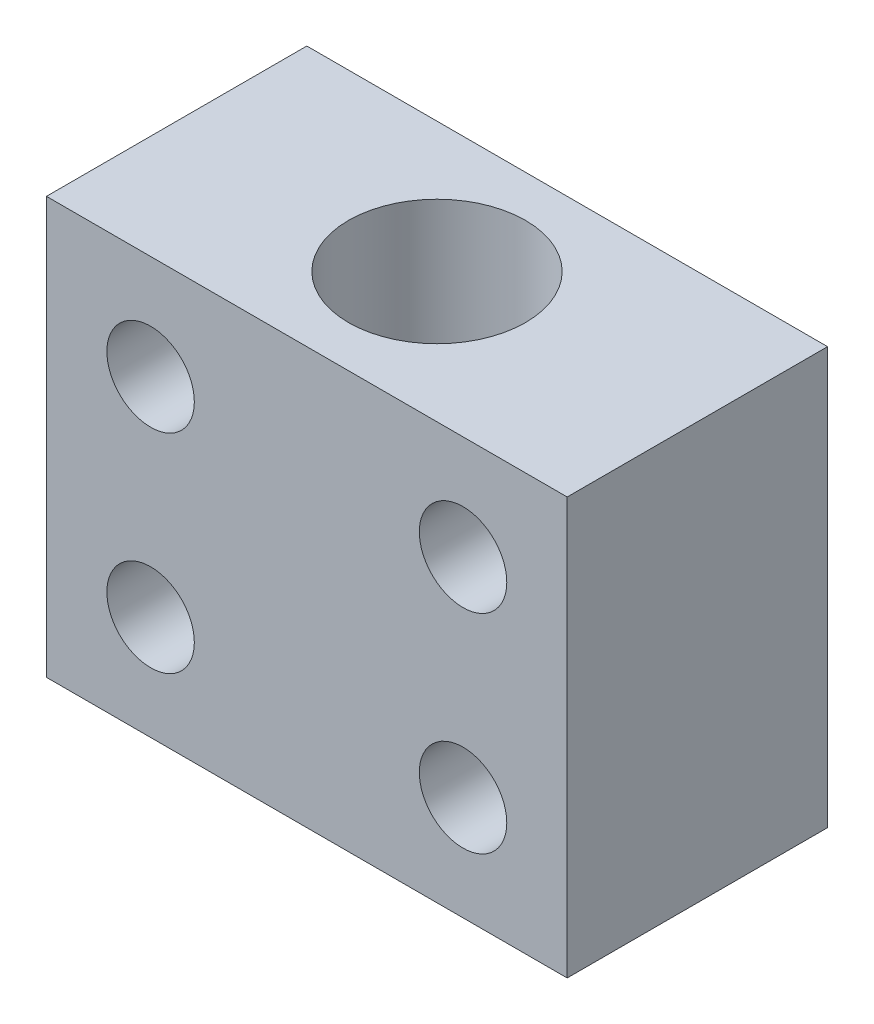
ISO-10303-21;
HEADER;
FILE_DESCRIPTION(('STEP AP214'),'2;1');
FILE_NAME('part.step','',(''),(''),'','','');
FILE_SCHEMA(('AUTOMOTIVE_DESIGN { 1 0 10303 214 1 1 1 1 }'));
ENDSEC;
DATA;
#1=APPLICATION_CONTEXT('core data for automotive mechanical design processes');
#2=APPLICATION_PROTOCOL_DEFINITION('international standard','automotive_design',2000,#1);
#3=PRODUCT_CONTEXT('',#1,'mechanical');
#4=PRODUCT('Part','Part','',(#3));
#5=PRODUCT_RELATED_PRODUCT_CATEGORY('part','',(#4));
#6=PRODUCT_DEFINITION_FORMATION('','',#4);
#7=PRODUCT_DEFINITION_CONTEXT('part definition',#1,'design');
#8=PRODUCT_DEFINITION('design','',#6,#7);
#9=PRODUCT_DEFINITION_SHAPE('','',#8);
#10=(LENGTH_UNIT() NAMED_UNIT(*) SI_UNIT(.MILLI.,.METRE.));
#11=(NAMED_UNIT(*) PLANE_ANGLE_UNIT() SI_UNIT($,.RADIAN.));
#12=(NAMED_UNIT(*) SI_UNIT($,.STERADIAN.) SOLID_ANGLE_UNIT());
#13=UNCERTAINTY_MEASURE_WITH_UNIT(LENGTH_MEASURE(1.E-05),#10,'distance_accuracy_value','');
#14=(GEOMETRIC_REPRESENTATION_CONTEXT(3) GLOBAL_UNCERTAINTY_ASSIGNED_CONTEXT((#13)) GLOBAL_UNIT_ASSIGNED_CONTEXT((#10,
#11,#12)) REPRESENTATION_CONTEXT('',''));
#15=CARTESIAN_POINT('',(0.,0.,0.));
#16=DIRECTION('',(0.,0.,1.));
#17=DIRECTION('',(1.,0.,0.));
#18=AXIS2_PLACEMENT_3D('',#15,#16,#17);
#19=CARTESIAN_POINT('',(0.,0.,-12.5));
#20=DIRECTION('',(0.,0.,-1.));
#21=DIRECTION('',(-1.,0.,0.));
#22=AXIS2_PLACEMENT_3D('',#19,#20,#21);
#23=PLANE('',#22);
#24=CARTESIAN_POINT('',(-15.,10.,-12.5));
#25=DIRECTION('',(0.,0.,1.));
#26=DIRECTION('',(1.,0.,0.));
#27=AXIS2_PLACEMENT_3D('',#24,#25,#26);
#28=CIRCLE('',#27,4.19999999999999);
#29=CARTESIAN_POINT('',(-10.8,10.,-12.5));
#30=VERTEX_POINT('',#29);
#31=EDGE_CURVE('E127',#30,#30,#28,.T.);
#32=ORIENTED_EDGE('',*,*,#31,.T.);
#33=EDGE_LOOP('',(#32));
#34=FACE_BOUND('',#33,.T.);
#35=DIRECTION('',(0.,1.,0.));
#36=VECTOR('',#35,1.);
#37=CARTESIAN_POINT('',(25.,-20.,-12.5));
#38=LINE('',#37,#36);
#39=CARTESIAN_POINT('',(25.,-20.,-12.5));
#40=VERTEX_POINT('',#39);
#41=CARTESIAN_POINT('',(25.,20.,-12.5));
#42=VERTEX_POINT('',#41);
#43=EDGE_CURVE('E96',#40,#42,#38,.T.);
#44=ORIENTED_EDGE('',*,*,#43,.F.);
#45=DIRECTION('',(1.,0.,0.));
#46=VECTOR('',#45,1.);
#47=CARTESIAN_POINT('',(-25.,-20.,-12.5));
#48=LINE('',#47,#46);
#49=CARTESIAN_POINT('',(-25.,-20.,-12.5));
#50=VERTEX_POINT('',#49);
#51=EDGE_CURVE('E72',#50,#40,#48,.T.);
#52=ORIENTED_EDGE('',*,*,#51,.F.);
#53=DIRECTION('',(0.,-1.,0.));
#54=VECTOR('',#53,1.);
#55=CARTESIAN_POINT('',(-25.,-20.,-12.5));
#56=LINE('',#55,#54);
#57=CARTESIAN_POINT('',(-25.,20.,-12.5));
#58=VERTEX_POINT('',#57);
#59=EDGE_CURVE('E66',#58,#50,#56,.T.);
#60=ORIENTED_EDGE('',*,*,#59,.F.);
#61=DIRECTION('',(-1.,0.,0.));
#62=VECTOR('',#61,1.);
#63=CARTESIAN_POINT('',(-25.,20.,-12.5));
#64=LINE('',#63,#62);
#65=EDGE_CURVE('E88',#42,#58,#64,.T.);
#66=ORIENTED_EDGE('',*,*,#65,.F.);
#67=EDGE_LOOP('',(#44,#52,#60,#66));
#68=FACE_BOUND('',#67,.T.);
#69=CARTESIAN_POINT('',(15.,10.,-12.5));
#70=DIRECTION('',(0.,0.,1.));
#71=DIRECTION('',(1.,0.,0.));
#72=AXIS2_PLACEMENT_3D('',#69,#70,#71);
#73=CIRCLE('',#72,4.19999999999999);
#74=CARTESIAN_POINT('',(19.2,10.,-12.5));
#75=VERTEX_POINT('',#74);
#76=EDGE_CURVE('E99',#75,#75,#73,.T.);
#77=ORIENTED_EDGE('',*,*,#76,.T.);
#78=EDGE_LOOP('',(#77));
#79=FACE_BOUND('',#78,.T.);
#80=CARTESIAN_POINT('',(15.,-10.,-12.5));
#81=DIRECTION('',(0.,0.,1.));
#82=DIRECTION('',(1.,0.,0.));
#83=AXIS2_PLACEMENT_3D('',#80,#81,#82);
#84=CIRCLE('',#83,4.19999999999999);
#85=CARTESIAN_POINT('',(19.2,-10.,-12.5));
#86=VERTEX_POINT('',#85);
#87=EDGE_CURVE('E115',#86,#86,#84,.T.);
#88=ORIENTED_EDGE('',*,*,#87,.T.);
#89=EDGE_LOOP('',(#88));
#90=FACE_BOUND('',#89,.T.);
#91=CARTESIAN_POINT('',(-15.,-10.,-12.5));
#92=DIRECTION('',(0.,0.,1.));
#93=DIRECTION('',(1.,0.,0.));
#94=AXIS2_PLACEMENT_3D('',#91,#92,#93);
#95=CIRCLE('',#94,4.19999999999999);
#96=CARTESIAN_POINT('',(-10.8,-10.,-12.5));
#97=VERTEX_POINT('',#96);
#98=EDGE_CURVE('E121',#97,#97,#95,.T.);
#99=ORIENTED_EDGE('',*,*,#98,.T.);
#100=EDGE_LOOP('',(#99));
#101=FACE_BOUND('',#100,.T.);
#102=ADVANCED_FACE('F32',(#34,#68,#79,#90,#101),#23,.T.);
#103=CARTESIAN_POINT('',(25.,-20.,12.5));
#104=DIRECTION('',(-1.,0.,0.));
#105=DIRECTION('',(0.,0.,1.));
#106=AXIS2_PLACEMENT_3D('',#103,#104,#105);
#107=PLANE('',#106);
#108=ORIENTED_EDGE('',*,*,#43,.T.);
#109=DIRECTION('',(0.,0.,-1.));
#110=VECTOR('',#109,1.);
#111=CARTESIAN_POINT('',(25.,20.,12.5));
#112=LINE('',#111,#110);
#113=CARTESIAN_POINT('',(25.,20.,12.5));
#114=VERTEX_POINT('',#113);
#115=EDGE_CURVE('E11',#114,#42,#112,.T.);
#116=ORIENTED_EDGE('',*,*,#115,.F.);
#117=DIRECTION('',(0.,1.,0.));
#118=VECTOR('',#117,1.);
#119=CARTESIAN_POINT('',(25.,-20.,12.5));
#120=LINE('',#119,#118);
#121=CARTESIAN_POINT('',(25.,-20.,12.5));
#122=VERTEX_POINT('',#121);
#123=EDGE_CURVE('E84',#122,#114,#120,.T.);
#124=ORIENTED_EDGE('',*,*,#123,.F.);
#125=DIRECTION('',(0.,0.,-1.));
#126=VECTOR('',#125,1.);
#127=CARTESIAN_POINT('',(25.,-20.,12.5));
#128=LINE('',#127,#126);
#129=EDGE_CURVE('E92',#122,#40,#128,.T.);
#130=ORIENTED_EDGE('',*,*,#129,.T.);
#131=EDGE_LOOP('',(#108,#116,#124,#130));
#132=FACE_BOUND('',#131,.T.);
#133=ADVANCED_FACE('F34',(#132),#107,.F.);
#134=CARTESIAN_POINT('',(-25.,20.,12.5));
#135=DIRECTION('',(0.,-1.,0.));
#136=DIRECTION('',(0.,0.,-1.));
#137=AXIS2_PLACEMENT_3D('',#134,#135,#136);
#138=PLANE('',#137);
#139=CARTESIAN_POINT('',(0.,20.,0.));
#140=DIRECTION('',(0.,1.,0.));
#141=DIRECTION('',(0.,0.,1.));
#142=AXIS2_PLACEMENT_3D('',#139,#140,#141);
#143=CIRCLE('',#142,8.5);
#144=CARTESIAN_POINT('',(0.,20.,8.5));
#145=VERTEX_POINT('',#144);
#146=EDGE_CURVE('E136',#145,#145,#143,.T.);
#147=ORIENTED_EDGE('',*,*,#146,.F.);
#148=EDGE_LOOP('',(#147));
#149=FACE_BOUND('',#148,.T.);
#150=ORIENTED_EDGE('',*,*,#65,.T.);
#151=DIRECTION('',(0.,0.,-1.));
#152=VECTOR('',#151,1.);
#153=CARTESIAN_POINT('',(-25.,20.,12.5));
#154=LINE('',#153,#152);
#155=CARTESIAN_POINT('',(-25.,20.,12.5));
#156=VERTEX_POINT('',#155);
#157=EDGE_CURVE('E41',#156,#58,#154,.T.);
#158=ORIENTED_EDGE('',*,*,#157,.F.);
#159=DIRECTION('',(-1.,0.,0.));
#160=VECTOR('',#159,1.);
#161=CARTESIAN_POINT('',(-25.,20.,12.5));
#162=LINE('',#161,#160);
#163=EDGE_CURVE('E79',#114,#156,#162,.T.);
#164=ORIENTED_EDGE('',*,*,#163,.F.);
#165=ORIENTED_EDGE('',*,*,#115,.T.);
#166=EDGE_LOOP('',(#150,#158,#164,#165));
#167=FACE_BOUND('',#166,.T.);
#168=ADVANCED_FACE('F87',(#149,#167),#138,.F.);
#169=CARTESIAN_POINT('',(-25.,-20.,12.5));
#170=DIRECTION('',(1.,0.,0.));
#171=DIRECTION('',(0.,0.,-1.));
#172=AXIS2_PLACEMENT_3D('',#169,#170,#171);
#173=PLANE('',#172);
#174=ORIENTED_EDGE('',*,*,#59,.T.);
#175=DIRECTION('',(0.,0.,-1.));
#176=VECTOR('',#175,1.);
#177=CARTESIAN_POINT('',(-25.,-20.,12.5));
#178=LINE('',#177,#176);
#179=CARTESIAN_POINT('',(-25.,-20.,12.5));
#180=VERTEX_POINT('',#179);
#181=EDGE_CURVE('E89',#180,#50,#178,.T.);
#182=ORIENTED_EDGE('',*,*,#181,.F.);
#183=DIRECTION('',(0.,-1.,0.));
#184=VECTOR('',#183,1.);
#185=CARTESIAN_POINT('',(-25.,-20.,12.5));
#186=LINE('',#185,#184);
#187=EDGE_CURVE('E82',#156,#180,#186,.T.);
#188=ORIENTED_EDGE('',*,*,#187,.F.);
#189=ORIENTED_EDGE('',*,*,#157,.T.);
#190=EDGE_LOOP('',(#174,#182,#188,#189));
#191=FACE_BOUND('',#190,.T.);
#192=ADVANCED_FACE('F90',(#191),#173,.F.);
#193=CARTESIAN_POINT('',(-25.,-20.,12.5));
#194=DIRECTION('',(0.,1.,0.));
#195=DIRECTION('',(0.,0.,1.));
#196=AXIS2_PLACEMENT_3D('',#193,#194,#195);
#197=PLANE('',#196);
#198=CARTESIAN_POINT('',(0.,-20.,0.));
#199=DIRECTION('',(0.,1.,0.));
#200=DIRECTION('',(0.,0.,1.));
#201=AXIS2_PLACEMENT_3D('',#198,#199,#200);
#202=CIRCLE('',#201,8.49999999999999);
#203=CARTESIAN_POINT('',(0.,-20.,8.49999999999999));
#204=VERTEX_POINT('',#203);
#205=EDGE_CURVE('E133',#204,#204,#202,.T.);
#206=ORIENTED_EDGE('',*,*,#205,.T.);
#207=EDGE_LOOP('',(#206));
#208=FACE_BOUND('',#207,.T.);
#209=ORIENTED_EDGE('',*,*,#51,.T.);
#210=ORIENTED_EDGE('',*,*,#129,.F.);
#211=DIRECTION('',(1.,0.,0.));
#212=VECTOR('',#211,1.);
#213=CARTESIAN_POINT('',(-25.,-20.,12.5));
#214=LINE('',#213,#212);
#215=EDGE_CURVE('E49',#180,#122,#214,.T.);
#216=ORIENTED_EDGE('',*,*,#215,.F.);
#217=ORIENTED_EDGE('',*,*,#181,.T.);
#218=EDGE_LOOP('',(#209,#210,#216,#217));
#219=FACE_BOUND('',#218,.T.);
#220=ADVANCED_FACE('F104',(#208,#219),#197,.F.);
#221=CARTESIAN_POINT('',(0.,0.,12.5));
#222=DIRECTION('',(0.,0.,-1.));
#223=DIRECTION('',(-1.,0.,0.));
#224=AXIS2_PLACEMENT_3D('',#221,#222,#223);
#225=PLANE('',#224);
#226=CARTESIAN_POINT('',(-15.,10.,12.5));
#227=DIRECTION('',(0.,0.,1.));
#228=DIRECTION('',(1.,0.,0.));
#229=AXIS2_PLACEMENT_3D('',#226,#227,#228);
#230=CIRCLE('',#229,4.19999999999999);
#231=CARTESIAN_POINT('',(-10.8,10.,12.5));
#232=VERTEX_POINT('',#231);
#233=EDGE_CURVE('E130',#232,#232,#230,.T.);
#234=ORIENTED_EDGE('',*,*,#233,.F.);
#235=EDGE_LOOP('',(#234));
#236=FACE_BOUND('',#235,.T.);
#237=CARTESIAN_POINT('',(-15.,-10.,12.5));
#238=DIRECTION('',(0.,0.,1.));
#239=DIRECTION('',(1.,0.,0.));
#240=AXIS2_PLACEMENT_3D('',#237,#238,#239);
#241=CIRCLE('',#240,4.19999999999999);
#242=CARTESIAN_POINT('',(-10.8,-10.,12.5));
#243=VERTEX_POINT('',#242);
#244=EDGE_CURVE('E124',#243,#243,#241,.T.);
#245=ORIENTED_EDGE('',*,*,#244,.F.);
#246=EDGE_LOOP('',(#245));
#247=FACE_BOUND('',#246,.T.);
#248=CARTESIAN_POINT('',(15.,-10.,12.5));
#249=DIRECTION('',(0.,0.,1.));
#250=DIRECTION('',(1.,0.,0.));
#251=AXIS2_PLACEMENT_3D('',#248,#249,#250);
#252=CIRCLE('',#251,4.19999999999999);
#253=CARTESIAN_POINT('',(19.2,-10.,12.5));
#254=VERTEX_POINT('',#253);
#255=EDGE_CURVE('E118',#254,#254,#252,.T.);
#256=ORIENTED_EDGE('',*,*,#255,.F.);
#257=EDGE_LOOP('',(#256));
#258=FACE_BOUND('',#257,.T.);
#259=CARTESIAN_POINT('',(15.,10.,12.5));
#260=DIRECTION('',(0.,0.,1.));
#261=DIRECTION('',(1.,0.,0.));
#262=AXIS2_PLACEMENT_3D('',#259,#260,#261);
#263=CIRCLE('',#262,4.19999999999999);
#264=CARTESIAN_POINT('',(19.2,10.,12.5));
#265=VERTEX_POINT('',#264);
#266=EDGE_CURVE('E112',#265,#265,#263,.T.);
#267=ORIENTED_EDGE('',*,*,#266,.F.);
#268=EDGE_LOOP('',(#267));
#269=FACE_BOUND('',#268,.T.);
#270=ORIENTED_EDGE('',*,*,#123,.T.);
#271=ORIENTED_EDGE('',*,*,#163,.T.);
#272=ORIENTED_EDGE('',*,*,#187,.T.);
#273=ORIENTED_EDGE('',*,*,#215,.T.);
#274=EDGE_LOOP('',(#270,#271,#272,#273));
#275=FACE_BOUND('',#274,.T.);
#276=ADVANCED_FACE('F80',(#236,#247,#258,#269,#275),#225,.F.);
#277=CARTESIAN_POINT('',(15.,10.,12.5));
#278=DIRECTION('',(0.,0.,1.));
#279=DIRECTION('',(1.,0.,0.));
#280=AXIS2_PLACEMENT_3D('',#277,#278,#279);
#281=CYLINDRICAL_SURFACE('',#280,4.19999999999999);
#282=ORIENTED_EDGE('',*,*,#76,.F.);
#283=EDGE_LOOP('',(#282));
#284=FACE_BOUND('',#283,.T.);
#285=ORIENTED_EDGE('',*,*,#266,.T.);
#286=EDGE_LOOP('',(#285));
#287=FACE_BOUND('',#286,.T.);
#288=ADVANCED_FACE('F161',(#284,#287),#281,.F.);
#289=CARTESIAN_POINT('',(15.,-10.,12.5));
#290=DIRECTION('',(0.,0.,1.));
#291=DIRECTION('',(1.,0.,0.));
#292=AXIS2_PLACEMENT_3D('',#289,#290,#291);
#293=CYLINDRICAL_SURFACE('',#292,4.19999999999999);
#294=ORIENTED_EDGE('',*,*,#87,.F.);
#295=EDGE_LOOP('',(#294));
#296=FACE_BOUND('',#295,.T.);
#297=ORIENTED_EDGE('',*,*,#255,.T.);
#298=EDGE_LOOP('',(#297));
#299=FACE_BOUND('',#298,.T.);
#300=ADVANCED_FACE('F177',(#296,#299),#293,.F.);
#301=CARTESIAN_POINT('',(-15.,-10.,12.5));
#302=DIRECTION('',(0.,0.,1.));
#303=DIRECTION('',(1.,0.,0.));
#304=AXIS2_PLACEMENT_3D('',#301,#302,#303);
#305=CYLINDRICAL_SURFACE('',#304,4.19999999999999);
#306=ORIENTED_EDGE('',*,*,#98,.F.);
#307=EDGE_LOOP('',(#306));
#308=FACE_BOUND('',#307,.T.);
#309=ORIENTED_EDGE('',*,*,#244,.T.);
#310=EDGE_LOOP('',(#309));
#311=FACE_BOUND('',#310,.T.);
#312=ADVANCED_FACE('F171',(#308,#311),#305,.F.);
#313=CARTESIAN_POINT('',(-15.,10.,12.5));
#314=DIRECTION('',(0.,0.,1.));
#315=DIRECTION('',(1.,0.,0.));
#316=AXIS2_PLACEMENT_3D('',#313,#314,#315);
#317=CYLINDRICAL_SURFACE('',#316,4.19999999999999);
#318=ORIENTED_EDGE('',*,*,#31,.F.);
#319=EDGE_LOOP('',(#318));
#320=FACE_BOUND('',#319,.T.);
#321=ORIENTED_EDGE('',*,*,#233,.T.);
#322=EDGE_LOOP('',(#321));
#323=FACE_BOUND('',#322,.T.);
#324=ADVANCED_FACE('F166',(#320,#323),#317,.F.);
#325=CARTESIAN_POINT('',(0.,20.,0.));
#326=DIRECTION('',(0.,1.,0.));
#327=DIRECTION('',(0.,0.,1.));
#328=AXIS2_PLACEMENT_3D('',#325,#326,#327);
#329=CYLINDRICAL_SURFACE('',#328,8.49999999999999);
#330=ORIENTED_EDGE('',*,*,#205,.F.);
#331=EDGE_LOOP('',(#330));
#332=FACE_BOUND('',#331,.T.);
#333=ORIENTED_EDGE('',*,*,#146,.T.);
#334=EDGE_LOOP('',(#333));
#335=FACE_BOUND('',#334,.T.);
#336=ADVANCED_FACE('F140',(#332,#335),#329,.F.);
#337=CLOSED_SHELL('',(#102,#133,#168,#192,#220,#276,#288,#300,#312,#324,#336));
#338=MANIFOLD_SOLID_BREP('B2',#337);
#339=ADVANCED_BREP_SHAPE_REPRESENTATION('',(#18,#338),#14);
#340=SHAPE_DEFINITION_REPRESENTATION(#9,#339);
ENDSEC;
END-ISO-10303-21;
